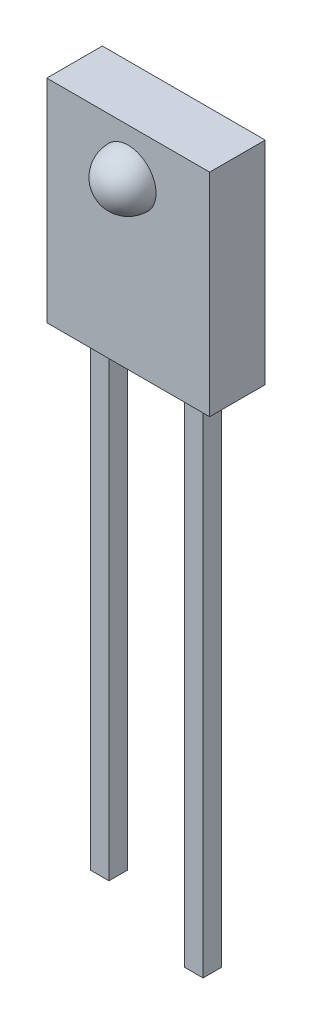
ISO-10303-21;
HEADER;
FILE_DESCRIPTION(('STEP AP214'),'2;1');
FILE_NAME('part.step','',(''),(''),'','','');
FILE_SCHEMA(('AUTOMOTIVE_DESIGN { 1 0 10303 214 1 1 1 1 }'));
ENDSEC;
DATA;
#1=APPLICATION_CONTEXT('core data for automotive mechanical design processes');
#2=APPLICATION_PROTOCOL_DEFINITION('international standard','automotive_design',2000,#1);
#3=PRODUCT_CONTEXT('',#1,'mechanical');
#4=PRODUCT('Part','Part','',(#3));
#5=PRODUCT_RELATED_PRODUCT_CATEGORY('part','',(#4));
#6=PRODUCT_DEFINITION_FORMATION('','',#4);
#7=PRODUCT_DEFINITION_CONTEXT('part definition',#1,'design');
#8=PRODUCT_DEFINITION('design','',#6,#7);
#9=PRODUCT_DEFINITION_SHAPE('','',#8);
#10=(LENGTH_UNIT() NAMED_UNIT(*) SI_UNIT(.MILLI.,.METRE.));
#11=(NAMED_UNIT(*) PLANE_ANGLE_UNIT() SI_UNIT($,.RADIAN.));
#12=(NAMED_UNIT(*) SI_UNIT($,.STERADIAN.) SOLID_ANGLE_UNIT());
#13=UNCERTAINTY_MEASURE_WITH_UNIT(LENGTH_MEASURE(1.E-05),#10,'distance_accuracy_value','');
#14=(GEOMETRIC_REPRESENTATION_CONTEXT(3) GLOBAL_UNCERTAINTY_ASSIGNED_CONTEXT((#13)) GLOBAL_UNIT_ASSIGNED_CONTEXT((#10,
#11,#12)) REPRESENTATION_CONTEXT('',''));
#15=CARTESIAN_POINT('',(0.,0.,0.));
#16=DIRECTION('',(0.,0.,1.));
#17=DIRECTION('',(1.,0.,0.));
#18=AXIS2_PLACEMENT_3D('',#15,#16,#17);
#19=CARTESIAN_POINT('',(2.19709999999999,-2.8575,0.7493));
#20=DIRECTION('',(0.,0.,1.));
#21=DIRECTION('',(1.,0.,0.));
#22=AXIS2_PLACEMENT_3D('',#19,#20,#21);
#23=PLANE('',#22);
#24=DIRECTION('',(0.,1.,0.));
#25=VECTOR('',#24,1.);
#26=CARTESIAN_POINT('',(2.19709999999999,2.8575,0.7493));
#27=LINE('',#26,#25);
#28=CARTESIAN_POINT('',(2.19709999999999,-2.8575,0.7493));
#29=VERTEX_POINT('',#28);
#30=CARTESIAN_POINT('',(2.19709999999999,2.8575,0.7493));
#31=VERTEX_POINT('',#30);
#32=EDGE_CURVE('E184',#29,#31,#27,.T.);
#33=ORIENTED_EDGE('',*,*,#32,.T.);
#34=DIRECTION('',(-1.,0.,0.));
#35=VECTOR('',#34,1.);
#36=CARTESIAN_POINT('',(-2.19710000000001,2.8575,0.7493));
#37=LINE('',#36,#35);
#38=CARTESIAN_POINT('',(-2.19710000000001,2.8575,0.7493));
#39=VERTEX_POINT('',#38);
#40=EDGE_CURVE('E200',#31,#39,#37,.T.);
#41=ORIENTED_EDGE('',*,*,#40,.T.);
#42=DIRECTION('',(0.,-1.,0.));
#43=VECTOR('',#42,1.);
#44=CARTESIAN_POINT('',(-2.19710000000001,2.8575,0.7493));
#45=LINE('',#44,#43);
#46=CARTESIAN_POINT('',(-2.1971,-2.8575,0.7493));
#47=VERTEX_POINT('',#46);
#48=EDGE_CURVE('E203',#39,#47,#45,.T.);
#49=ORIENTED_EDGE('',*,*,#48,.T.);
#50=DIRECTION('',(1.,0.,0.));
#51=VECTOR('',#50,1.);
#52=CARTESIAN_POINT('',(-2.1971,-2.8575,0.7493));
#53=LINE('',#52,#51);
#54=EDGE_CURVE('E189',#47,#29,#53,.T.);
#55=ORIENTED_EDGE('',*,*,#54,.T.);
#56=EDGE_LOOP('',(#33,#41,#49,#55));
#57=FACE_BOUND('',#56,.T.);
#58=CARTESIAN_POINT('',(0.,1.6375,0.7493));
#59=DIRECTION('',(0.,0.,1.));
#60=DIRECTION('',(1.,0.,0.));
#61=AXIS2_PLACEMENT_3D('',#58,#59,#60);
#62=CIRCLE('',#61,0.75);
#63=CARTESIAN_POINT('',(0.75,1.6375,0.7493));
#64=VERTEX_POINT('',#63);
#65=EDGE_CURVE('E181',#64,#64,#62,.T.);
#66=ORIENTED_EDGE('',*,*,#65,.F.);
#67=EDGE_LOOP('',(#66));
#68=FACE_BOUND('',#67,.T.);
#69=ADVANCED_FACE('F35',(#57,#68),#23,.T.);
#70=CARTESIAN_POINT('',(2.19709999999999,2.8575,-0.7493));
#71=DIRECTION('',(1.,0.,0.));
#72=DIRECTION('',(0.,1.,0.));
#73=AXIS2_PLACEMENT_3D('',#70,#71,#72);
#74=PLANE('',#73);
#75=ORIENTED_EDGE('',*,*,#32,.F.);
#76=DIRECTION('',(0.,0.,1.));
#77=VECTOR('',#76,1.);
#78=CARTESIAN_POINT('',(2.19709999999999,-2.8575,-0.7493));
#79=LINE('',#78,#77);
#80=CARTESIAN_POINT('',(2.19709999999999,-2.8575,-0.7493));
#81=VERTEX_POINT('',#80);
#82=EDGE_CURVE('E11',#81,#29,#79,.T.);
#83=ORIENTED_EDGE('',*,*,#82,.F.);
#84=DIRECTION('',(0.,1.,0.));
#85=VECTOR('',#84,1.);
#86=CARTESIAN_POINT('',(2.19709999999999,2.8575,-0.7493));
#87=LINE('',#86,#85);
#88=CARTESIAN_POINT('',(2.19709999999999,2.8575,-0.7493));
#89=VERTEX_POINT('',#88);
#90=EDGE_CURVE('E185',#81,#89,#87,.T.);
#91=ORIENTED_EDGE('',*,*,#90,.T.);
#92=DIRECTION('',(0.,0.,1.));
#93=VECTOR('',#92,1.);
#94=CARTESIAN_POINT('',(2.19709999999999,2.8575,-0.7493));
#95=LINE('',#94,#93);
#96=EDGE_CURVE('E39',#89,#31,#95,.T.);
#97=ORIENTED_EDGE('',*,*,#96,.T.);
#98=EDGE_LOOP('',(#75,#83,#91,#97));
#99=FACE_BOUND('',#98,.T.);
#100=ADVANCED_FACE('F37',(#99),#74,.T.);
#101=CARTESIAN_POINT('',(-2.1971,-2.8575,-0.7493));
#102=DIRECTION('',(0.,-1.,0.));
#103=DIRECTION('',(0.,0.,-1.));
#104=AXIS2_PLACEMENT_3D('',#101,#102,#103);
#105=PLANE('',#104);
#106=DIRECTION('',(-1.,0.,0.));
#107=VECTOR('',#106,1.);
#108=CARTESIAN_POINT('',(1.02,-2.8575,0.25));
#109=LINE('',#108,#107);
#110=CARTESIAN_POINT('',(1.52,-2.8575,0.25));
#111=VERTEX_POINT('',#110);
#112=CARTESIAN_POINT('',(1.02,-2.8575,0.25));
#113=VERTEX_POINT('',#112);
#114=EDGE_CURVE('E142',#111,#113,#109,.T.);
#115=ORIENTED_EDGE('',*,*,#114,.F.);
#116=DIRECTION('',(0.,0.,-1.));
#117=VECTOR('',#116,1.);
#118=CARTESIAN_POINT('',(1.52,-2.8575,0.25));
#119=LINE('',#118,#117);
#120=CARTESIAN_POINT('',(1.52,-2.8575,-0.25));
#121=VERTEX_POINT('',#120);
#122=EDGE_CURVE('E151',#111,#121,#119,.T.);
#123=ORIENTED_EDGE('',*,*,#122,.T.);
#124=DIRECTION('',(-1.,0.,0.));
#125=VECTOR('',#124,1.);
#126=CARTESIAN_POINT('',(1.02,-2.8575,-0.25));
#127=LINE('',#126,#125);
#128=CARTESIAN_POINT('',(1.02,-2.8575,-0.25));
#129=VERTEX_POINT('',#128);
#130=EDGE_CURVE('E145',#121,#129,#127,.T.);
#131=ORIENTED_EDGE('',*,*,#130,.T.);
#132=DIRECTION('',(0.,0.,-1.));
#133=VECTOR('',#132,1.);
#134=CARTESIAN_POINT('',(1.02,-2.8575,0.25));
#135=LINE('',#134,#133);
#136=EDGE_CURVE('E386',#113,#129,#135,.T.);
#137=ORIENTED_EDGE('',*,*,#136,.F.);
#138=EDGE_LOOP('',(#115,#123,#131,#137));
#139=FACE_BOUND('',#138,.T.);
#140=DIRECTION('',(-1.,0.,0.));
#141=VECTOR('',#140,1.);
#142=CARTESIAN_POINT('',(-1.52,-2.8575,0.25));
#143=LINE('',#142,#141);
#144=CARTESIAN_POINT('',(-1.02,-2.8575,0.25));
#145=VERTEX_POINT('',#144);
#146=CARTESIAN_POINT('',(-1.52,-2.8575,0.25));
#147=VERTEX_POINT('',#146);
#148=EDGE_CURVE('E163',#145,#147,#143,.T.);
#149=ORIENTED_EDGE('',*,*,#148,.F.);
#150=DIRECTION('',(0.,0.,-1.));
#151=VECTOR('',#150,1.);
#152=CARTESIAN_POINT('',(-1.02,-2.8575,0.25));
#153=LINE('',#152,#151);
#154=CARTESIAN_POINT('',(-1.02,-2.8575,-0.25));
#155=VERTEX_POINT('',#154);
#156=EDGE_CURVE('E172',#145,#155,#153,.T.);
#157=ORIENTED_EDGE('',*,*,#156,.T.);
#158=DIRECTION('',(-1.,0.,0.));
#159=VECTOR('',#158,1.);
#160=CARTESIAN_POINT('',(-1.52,-2.8575,-0.25));
#161=LINE('',#160,#159);
#162=CARTESIAN_POINT('',(-1.52,-2.8575,-0.25));
#163=VERTEX_POINT('',#162);
#164=EDGE_CURVE('E159',#155,#163,#161,.T.);
#165=ORIENTED_EDGE('',*,*,#164,.T.);
#166=DIRECTION('',(0.,0.,-1.));
#167=VECTOR('',#166,1.);
#168=CARTESIAN_POINT('',(-1.52,-2.8575,0.25));
#169=LINE('',#168,#167);
#170=EDGE_CURVE('E164',#147,#163,#169,.T.);
#171=ORIENTED_EDGE('',*,*,#170,.F.);
#172=EDGE_LOOP('',(#149,#157,#165,#171));
#173=FACE_BOUND('',#172,.T.);
#174=ORIENTED_EDGE('',*,*,#54,.F.);
#175=DIRECTION('',(0.,0.,1.));
#176=VECTOR('',#175,1.);
#177=CARTESIAN_POINT('',(-2.1971,-2.8575,-0.7493));
#178=LINE('',#177,#176);
#179=CARTESIAN_POINT('',(-2.1971,-2.8575,-0.7493));
#180=VERTEX_POINT('',#179);
#181=EDGE_CURVE('E44',#180,#47,#178,.T.);
#182=ORIENTED_EDGE('',*,*,#181,.F.);
#183=DIRECTION('',(1.,0.,0.));
#184=VECTOR('',#183,1.);
#185=CARTESIAN_POINT('',(-2.1971,-2.8575,-0.7493));
#186=LINE('',#185,#184);
#187=EDGE_CURVE('E195',#180,#81,#186,.T.);
#188=ORIENTED_EDGE('',*,*,#187,.T.);
#189=ORIENTED_EDGE('',*,*,#82,.T.);
#190=EDGE_LOOP('',(#174,#182,#188,#189));
#191=FACE_BOUND('',#190,.T.);
#192=ADVANCED_FACE('F221',(#139,#173,#191),#105,.T.);
#193=CARTESIAN_POINT('',(-2.19710000000001,2.8575,-0.7493));
#194=DIRECTION('',(-1.,0.,0.));
#195=DIRECTION('',(0.,-1.,0.));
#196=AXIS2_PLACEMENT_3D('',#193,#194,#195);
#197=PLANE('',#196);
#198=ORIENTED_EDGE('',*,*,#48,.F.);
#199=DIRECTION('',(0.,0.,1.));
#200=VECTOR('',#199,1.);
#201=CARTESIAN_POINT('',(-2.19710000000001,2.8575,-0.7493));
#202=LINE('',#201,#200);
#203=CARTESIAN_POINT('',(-2.19710000000001,2.8575,-0.7493));
#204=VERTEX_POINT('',#203);
#205=EDGE_CURVE('E208',#204,#39,#202,.T.);
#206=ORIENTED_EDGE('',*,*,#205,.F.);
#207=DIRECTION('',(0.,-1.,0.));
#208=VECTOR('',#207,1.);
#209=CARTESIAN_POINT('',(-2.19710000000001,2.8575,-0.7493));
#210=LINE('',#209,#208);
#211=EDGE_CURVE('E192',#204,#180,#210,.T.);
#212=ORIENTED_EDGE('',*,*,#211,.T.);
#213=ORIENTED_EDGE('',*,*,#181,.T.);
#214=EDGE_LOOP('',(#198,#206,#212,#213));
#215=FACE_BOUND('',#214,.T.);
#216=ADVANCED_FACE('F227',(#215),#197,.T.);
#217=CARTESIAN_POINT('',(-2.19710000000001,2.8575,-0.7493));
#218=DIRECTION('',(0.,1.,0.));
#219=DIRECTION('',(0.,0.,1.));
#220=AXIS2_PLACEMENT_3D('',#217,#218,#219);
#221=PLANE('',#220);
#222=ORIENTED_EDGE('',*,*,#40,.F.);
#223=ORIENTED_EDGE('',*,*,#96,.F.);
#224=DIRECTION('',(-1.,0.,0.));
#225=VECTOR('',#224,1.);
#226=CARTESIAN_POINT('',(-2.19710000000001,2.8575,-0.7493));
#227=LINE('',#226,#225);
#228=EDGE_CURVE('E188',#89,#204,#227,.T.);
#229=ORIENTED_EDGE('',*,*,#228,.T.);
#230=ORIENTED_EDGE('',*,*,#205,.T.);
#231=EDGE_LOOP('',(#222,#223,#229,#230));
#232=FACE_BOUND('',#231,.T.);
#233=ADVANCED_FACE('F216',(#232),#221,.T.);
#234=CARTESIAN_POINT('',(2.19709999999999,-2.8575,-0.7493));
#235=DIRECTION('',(0.,0.,1.));
#236=DIRECTION('',(1.,0.,0.));
#237=AXIS2_PLACEMENT_3D('',#234,#235,#236);
#238=PLANE('',#237);
#239=ORIENTED_EDGE('',*,*,#90,.F.);
#240=ORIENTED_EDGE('',*,*,#187,.F.);
#241=ORIENTED_EDGE('',*,*,#211,.F.);
#242=ORIENTED_EDGE('',*,*,#228,.F.);
#243=EDGE_LOOP('',(#239,#240,#241,#242));
#244=FACE_BOUND('',#243,.T.);
#245=ADVANCED_FACE('F224',(#244),#238,.F.);
#246=CARTESIAN_POINT('',(0.,1.6375,0.7493));
#247=DIRECTION('',(0.,0.,1.));
#248=DIRECTION('',(0.,1.,0.));
#249=AXIS2_PLACEMENT_3D('',#246,#247,#248);
#250=SPHERICAL_SURFACE('',#249,0.75);
#251=ORIENTED_EDGE('',*,*,#65,.T.);
#252=EDGE_LOOP('',(#251));
#253=FACE_BOUND('',#252,.T.);
#254=ADVANCED_FACE('F244',(#253),#250,.T.);
#255=CARTESIAN_POINT('',(-1.52,-2.8575,0.25));
#256=DIRECTION('',(1.,0.,0.));
#257=DIRECTION('',(0.,1.,0.));
#258=AXIS2_PLACEMENT_3D('',#255,#256,#257);
#259=PLANE('',#258);
#260=DIRECTION('',(0.,-1.,0.));
#261=VECTOR('',#260,1.);
#262=CARTESIAN_POINT('',(-1.52,-2.8575,-0.25));
#263=LINE('',#262,#261);
#264=CARTESIAN_POINT('',(-1.52,-15.5575,-0.25));
#265=VERTEX_POINT('',#264);
#266=EDGE_CURVE('E60',#163,#265,#263,.T.);
#267=ORIENTED_EDGE('',*,*,#266,.T.);
#268=DIRECTION('',(0.,0.,-1.));
#269=VECTOR('',#268,1.);
#270=CARTESIAN_POINT('',(-1.52,-15.5575,0.25));
#271=LINE('',#270,#269);
#272=CARTESIAN_POINT('',(-1.52,-15.5575,0.25));
#273=VERTEX_POINT('',#272);
#274=EDGE_CURVE('E178',#273,#265,#271,.T.);
#275=ORIENTED_EDGE('',*,*,#274,.F.);
#276=DIRECTION('',(0.,-1.,0.));
#277=VECTOR('',#276,1.);
#278=CARTESIAN_POINT('',(-1.52,-2.8575,0.25));
#279=LINE('',#278,#277);
#280=EDGE_CURVE('E155',#147,#273,#279,.T.);
#281=ORIENTED_EDGE('',*,*,#280,.F.);
#282=ORIENTED_EDGE('',*,*,#170,.T.);
#283=EDGE_LOOP('',(#267,#275,#281,#282));
#284=FACE_BOUND('',#283,.T.);
#285=ADVANCED_FACE('F247',(#284),#259,.F.);
#286=CARTESIAN_POINT('',(-1.52,-15.5575,0.25));
#287=DIRECTION('',(0.,1.,0.));
#288=DIRECTION('',(0.,0.,1.));
#289=AXIS2_PLACEMENT_3D('',#286,#287,#288);
#290=PLANE('',#289);
#291=DIRECTION('',(1.,0.,0.));
#292=VECTOR('',#291,1.);
#293=CARTESIAN_POINT('',(-1.52,-15.5575,-0.25));
#294=LINE('',#293,#292);
#295=CARTESIAN_POINT('',(-1.02,-15.5575,-0.25));
#296=VERTEX_POINT('',#295);
#297=EDGE_CURVE('E149',#265,#296,#294,.T.);
#298=ORIENTED_EDGE('',*,*,#297,.T.);
#299=DIRECTION('',(0.,0.,-1.));
#300=VECTOR('',#299,1.);
#301=CARTESIAN_POINT('',(-1.02,-15.5575,0.25));
#302=LINE('',#301,#300);
#303=CARTESIAN_POINT('',(-1.02,-15.5575,0.25));
#304=VERTEX_POINT('',#303);
#305=EDGE_CURVE('E175',#304,#296,#302,.T.);
#306=ORIENTED_EDGE('',*,*,#305,.F.);
#307=DIRECTION('',(1.,0.,0.));
#308=VECTOR('',#307,1.);
#309=CARTESIAN_POINT('',(-1.52,-15.5575,0.25));
#310=LINE('',#309,#308);
#311=EDGE_CURVE('E158',#273,#304,#310,.T.);
#312=ORIENTED_EDGE('',*,*,#311,.F.);
#313=ORIENTED_EDGE('',*,*,#274,.T.);
#314=EDGE_LOOP('',(#298,#306,#312,#313));
#315=FACE_BOUND('',#314,.T.);
#316=ADVANCED_FACE('F251',(#315),#290,.F.);
#317=CARTESIAN_POINT('',(-1.02,-2.8575,0.25));
#318=DIRECTION('',(-1.,0.,0.));
#319=DIRECTION('',(0.,-1.,0.));
#320=AXIS2_PLACEMENT_3D('',#317,#318,#319);
#321=PLANE('',#320);
#322=DIRECTION('',(0.,1.,0.));
#323=VECTOR('',#322,1.);
#324=CARTESIAN_POINT('',(-1.02,-2.8575,-0.25));
#325=LINE('',#324,#323);
#326=EDGE_CURVE('E167',#296,#155,#325,.T.);
#327=ORIENTED_EDGE('',*,*,#326,.T.);
#328=ORIENTED_EDGE('',*,*,#156,.F.);
#329=DIRECTION('',(0.,1.,0.));
#330=VECTOR('',#329,1.);
#331=CARTESIAN_POINT('',(-1.02,-2.8575,0.25));
#332=LINE('',#331,#330);
#333=EDGE_CURVE('E161',#304,#145,#332,.T.);
#334=ORIENTED_EDGE('',*,*,#333,.F.);
#335=ORIENTED_EDGE('',*,*,#305,.T.);
#336=EDGE_LOOP('',(#327,#328,#334,#335));
#337=FACE_BOUND('',#336,.T.);
#338=ADVANCED_FACE('F255',(#337),#321,.F.);
#339=CARTESIAN_POINT('',(-1.52,-15.5575,0.25));
#340=DIRECTION('',(0.,0.,1.));
#341=DIRECTION('',(1.,0.,0.));
#342=AXIS2_PLACEMENT_3D('',#339,#340,#341);
#343=PLANE('',#342);
#344=ORIENTED_EDGE('',*,*,#280,.T.);
#345=ORIENTED_EDGE('',*,*,#311,.T.);
#346=ORIENTED_EDGE('',*,*,#333,.T.);
#347=ORIENTED_EDGE('',*,*,#148,.T.);
#348=EDGE_LOOP('',(#344,#345,#346,#347));
#349=FACE_BOUND('',#348,.T.);
#350=ADVANCED_FACE('F259',(#349),#343,.T.);
#351=CARTESIAN_POINT('',(-1.52,-15.5575,-0.25));
#352=DIRECTION('',(0.,0.,1.));
#353=DIRECTION('',(1.,0.,0.));
#354=AXIS2_PLACEMENT_3D('',#351,#352,#353);
#355=PLANE('',#354);
#356=ORIENTED_EDGE('',*,*,#266,.F.);
#357=ORIENTED_EDGE('',*,*,#164,.F.);
#358=ORIENTED_EDGE('',*,*,#326,.F.);
#359=ORIENTED_EDGE('',*,*,#297,.F.);
#360=EDGE_LOOP('',(#356,#357,#358,#359));
#361=FACE_BOUND('',#360,.T.);
#362=ADVANCED_FACE('F261',(#361),#355,.F.);
#363=CARTESIAN_POINT('',(1.02,-2.8575,0.25));
#364=DIRECTION('',(1.,0.,0.));
#365=DIRECTION('',(0.,1.,0.));
#366=AXIS2_PLACEMENT_3D('',#363,#364,#365);
#367=PLANE('',#366);
#368=DIRECTION('',(0.,-1.,0.));
#369=VECTOR('',#368,1.);
#370=CARTESIAN_POINT('',(1.02,-2.8575,-0.25));
#371=LINE('',#370,#369);
#372=CARTESIAN_POINT('',(1.02,-16.5575,-0.25));
#373=VERTEX_POINT('',#372);
#374=EDGE_CURVE('E52',#129,#373,#371,.T.);
#375=ORIENTED_EDGE('',*,*,#374,.T.);
#376=DIRECTION('',(0.,0.,-1.));
#377=VECTOR('',#376,1.);
#378=CARTESIAN_POINT('',(1.02,-16.5575,0.25));
#379=LINE('',#378,#377);
#380=CARTESIAN_POINT('',(1.02,-16.5575,0.25));
#381=VERTEX_POINT('',#380);
#382=EDGE_CURVE('E131',#381,#373,#379,.T.);
#383=ORIENTED_EDGE('',*,*,#382,.F.);
#384=DIRECTION('',(0.,-1.,0.));
#385=VECTOR('',#384,1.);
#386=CARTESIAN_POINT('',(1.02,-2.8575,0.25));
#387=LINE('',#386,#385);
#388=EDGE_CURVE('E137',#113,#381,#387,.T.);
#389=ORIENTED_EDGE('',*,*,#388,.F.);
#390=ORIENTED_EDGE('',*,*,#136,.T.);
#391=EDGE_LOOP('',(#375,#383,#389,#390));
#392=FACE_BOUND('',#391,.T.);
#393=ADVANCED_FACE('F147',(#392),#367,.F.);
#394=CARTESIAN_POINT('',(1.02,-16.5575,0.25));
#395=DIRECTION('',(0.,1.,0.));
#396=DIRECTION('',(0.,0.,1.));
#397=AXIS2_PLACEMENT_3D('',#394,#395,#396);
#398=PLANE('',#397);
#399=DIRECTION('',(1.,0.,0.));
#400=VECTOR('',#399,1.);
#401=CARTESIAN_POINT('',(1.02,-16.5575,-0.25));
#402=LINE('',#401,#400);
#403=CARTESIAN_POINT('',(1.52,-16.5575,-0.25));
#404=VERTEX_POINT('',#403);
#405=EDGE_CURVE('E381',#373,#404,#402,.T.);
#406=ORIENTED_EDGE('',*,*,#405,.T.);
#407=DIRECTION('',(0.,0.,-1.));
#408=VECTOR('',#407,1.);
#409=CARTESIAN_POINT('',(1.52,-16.5575,0.25));
#410=LINE('',#409,#408);
#411=CARTESIAN_POINT('',(1.52,-16.5575,0.25));
#412=VERTEX_POINT('',#411);
#413=EDGE_CURVE('E133',#412,#404,#410,.T.);
#414=ORIENTED_EDGE('',*,*,#413,.F.);
#415=DIRECTION('',(1.,0.,0.));
#416=VECTOR('',#415,1.);
#417=CARTESIAN_POINT('',(1.02,-16.5575,0.25));
#418=LINE('',#417,#416);
#419=EDGE_CURVE('E127',#381,#412,#418,.T.);
#420=ORIENTED_EDGE('',*,*,#419,.F.);
#421=ORIENTED_EDGE('',*,*,#382,.T.);
#422=EDGE_LOOP('',(#406,#414,#420,#421));
#423=FACE_BOUND('',#422,.T.);
#424=ADVANCED_FACE('F129',(#423),#398,.F.);
#425=CARTESIAN_POINT('',(1.52,-2.8575,0.25));
#426=DIRECTION('',(-1.,0.,0.));
#427=DIRECTION('',(0.,-1.,0.));
#428=AXIS2_PLACEMENT_3D('',#425,#426,#427);
#429=PLANE('',#428);
#430=DIRECTION('',(0.,1.,0.));
#431=VECTOR('',#430,1.);
#432=CARTESIAN_POINT('',(1.52,-2.8575,-0.25));
#433=LINE('',#432,#431);
#434=EDGE_CURVE('E379',#404,#121,#433,.T.);
#435=ORIENTED_EDGE('',*,*,#434,.T.);
#436=ORIENTED_EDGE('',*,*,#122,.F.);
#437=DIRECTION('',(0.,1.,0.));
#438=VECTOR('',#437,1.);
#439=CARTESIAN_POINT('',(1.52,-2.8575,0.25));
#440=LINE('',#439,#438);
#441=EDGE_CURVE('E136',#412,#111,#440,.T.);
#442=ORIENTED_EDGE('',*,*,#441,.F.);
#443=ORIENTED_EDGE('',*,*,#413,.T.);
#444=EDGE_LOOP('',(#435,#436,#442,#443));
#445=FACE_BOUND('',#444,.T.);
#446=ADVANCED_FACE('F271',(#445),#429,.F.);
#447=CARTESIAN_POINT('',(1.02,-16.5575,0.25));
#448=DIRECTION('',(0.,0.,1.));
#449=DIRECTION('',(1.,0.,0.));
#450=AXIS2_PLACEMENT_3D('',#447,#448,#449);
#451=PLANE('',#450);
#452=ORIENTED_EDGE('',*,*,#388,.T.);
#453=ORIENTED_EDGE('',*,*,#419,.T.);
#454=ORIENTED_EDGE('',*,*,#441,.T.);
#455=ORIENTED_EDGE('',*,*,#114,.T.);
#456=EDGE_LOOP('',(#452,#453,#454,#455));
#457=FACE_BOUND('',#456,.T.);
#458=ADVANCED_FACE('F140',(#457),#451,.T.);
#459=CARTESIAN_POINT('',(1.02,-16.5575,-0.25));
#460=DIRECTION('',(0.,0.,1.));
#461=DIRECTION('',(1.,0.,0.));
#462=AXIS2_PLACEMENT_3D('',#459,#460,#461);
#463=PLANE('',#462);
#464=ORIENTED_EDGE('',*,*,#374,.F.);
#465=ORIENTED_EDGE('',*,*,#130,.F.);
#466=ORIENTED_EDGE('',*,*,#434,.F.);
#467=ORIENTED_EDGE('',*,*,#405,.F.);
#468=EDGE_LOOP('',(#464,#465,#466,#467));
#469=FACE_BOUND('',#468,.T.);
#470=ADVANCED_FACE('F275',(#469),#463,.F.);
#471=CLOSED_SHELL('',(#69,#100,#192,#216,#233,#245,#254,#285,#316,#338,#350,#362,#393,#424,#446,
#458,#470));
#472=MANIFOLD_SOLID_BREP('B2',#471);
#473=ADVANCED_BREP_SHAPE_REPRESENTATION('',(#18,#472),#14);
#474=SHAPE_DEFINITION_REPRESENTATION(#9,#473);
ENDSEC;
END-ISO-10303-21;
